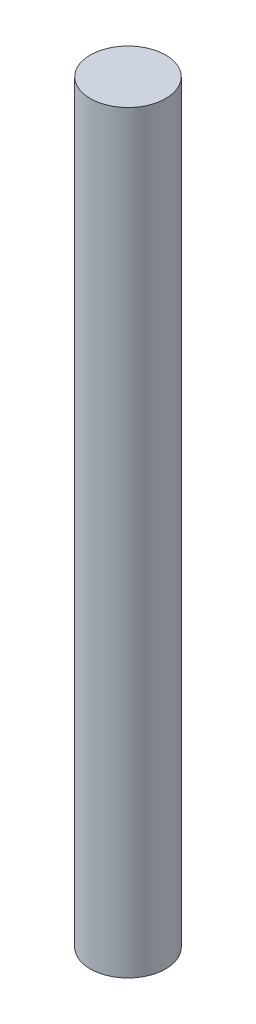
ISO-10303-21;
HEADER;
FILE_DESCRIPTION(('STEP AP214'),'2;1');
FILE_NAME('part.step','',(''),(''),'','','');
FILE_SCHEMA(('AUTOMOTIVE_DESIGN { 1 0 10303 214 1 1 1 1 }'));
ENDSEC;
DATA;
#1=APPLICATION_CONTEXT('core data for automotive mechanical design processes');
#2=APPLICATION_PROTOCOL_DEFINITION('international standard','automotive_design',2000,#1);
#3=PRODUCT_CONTEXT('',#1,'mechanical');
#4=PRODUCT('Part','Part','',(#3));
#5=PRODUCT_RELATED_PRODUCT_CATEGORY('part','',(#4));
#6=PRODUCT_DEFINITION_FORMATION('','',#4);
#7=PRODUCT_DEFINITION_CONTEXT('part definition',#1,'design');
#8=PRODUCT_DEFINITION('design','',#6,#7);
#9=PRODUCT_DEFINITION_SHAPE('','',#8);
#10=(LENGTH_UNIT() NAMED_UNIT(*) SI_UNIT(.MILLI.,.METRE.));
#11=(NAMED_UNIT(*) PLANE_ANGLE_UNIT() SI_UNIT($,.RADIAN.));
#12=(NAMED_UNIT(*) SI_UNIT($,.STERADIAN.) SOLID_ANGLE_UNIT());
#13=UNCERTAINTY_MEASURE_WITH_UNIT(LENGTH_MEASURE(1.E-05),#10,'distance_accuracy_value','');
#14=(GEOMETRIC_REPRESENTATION_CONTEXT(3) GLOBAL_UNCERTAINTY_ASSIGNED_CONTEXT((#13)) GLOBAL_UNIT_ASSIGNED_CONTEXT((#10,
#11,#12)) REPRESENTATION_CONTEXT('',''));
#15=CARTESIAN_POINT('',(0.,0.,0.));
#16=DIRECTION('',(0.,0.,1.));
#17=DIRECTION('',(1.,0.,0.));
#18=AXIS2_PLACEMENT_3D('',#15,#16,#17);
#19=CARTESIAN_POINT('',(0.,50.,0.));
#20=DIRECTION('',(0.,-1.,0.));
#21=DIRECTION('',(0.,0.,-1.));
#22=AXIS2_PLACEMENT_3D('',#19,#20,#21);
#23=CYLINDRICAL_SURFACE('',#22,2.5);
#24=CARTESIAN_POINT('',(0.,50.,0.));
#25=DIRECTION('',(0.,1.,0.));
#26=DIRECTION('',(0.,0.,1.));
#27=AXIS2_PLACEMENT_3D('',#24,#25,#26);
#28=CIRCLE('',#27,2.5);
#29=CARTESIAN_POINT('',(0.,50.,2.5));
#30=VERTEX_POINT('',#29);
#31=EDGE_CURVE('E10',#30,#30,#28,.T.);
#32=ORIENTED_EDGE('',*,*,#31,.F.);
#33=EDGE_LOOP('',(#32));
#34=FACE_BOUND('',#33,.T.);
#35=CARTESIAN_POINT('',(0.,0.,0.));
#36=DIRECTION('',(0.,1.,0.));
#37=DIRECTION('',(0.,0.,1.));
#38=AXIS2_PLACEMENT_3D('',#35,#36,#37);
#39=CIRCLE('',#38,2.5);
#40=CARTESIAN_POINT('',(0.,0.,2.5));
#41=VERTEX_POINT('',#40);
#42=EDGE_CURVE('E33',#41,#41,#39,.T.);
#43=ORIENTED_EDGE('',*,*,#42,.T.);
#44=EDGE_LOOP('',(#43));
#45=FACE_BOUND('',#44,.T.);
#46=ADVANCED_FACE('F30',(#34,#45),#23,.T.);
#47=CARTESIAN_POINT('',(0.,50.,0.));
#48=DIRECTION('',(0.,1.,0.));
#49=DIRECTION('',(0.,0.,1.));
#50=AXIS2_PLACEMENT_3D('',#47,#48,#49);
#51=PLANE('',#50);
#52=ORIENTED_EDGE('',*,*,#31,.T.);
#53=EDGE_LOOP('',(#52));
#54=FACE_BOUND('',#53,.T.);
#55=ADVANCED_FACE('F45',(#54),#51,.T.);
#56=CARTESIAN_POINT('',(0.,0.,0.));
#57=DIRECTION('',(0.,1.,0.));
#58=DIRECTION('',(0.,0.,1.));
#59=AXIS2_PLACEMENT_3D('',#56,#57,#58);
#60=PLANE('',#59);
#61=ORIENTED_EDGE('',*,*,#42,.F.);
#62=EDGE_LOOP('',(#61));
#63=FACE_BOUND('',#62,.T.);
#64=ADVANCED_FACE('F43',(#63),#60,.F.);
#65=CLOSED_SHELL('',(#46,#55,#64));
#66=MANIFOLD_SOLID_BREP('B2',#65);
#67=ADVANCED_BREP_SHAPE_REPRESENTATION('',(#18,#66),#14);
#68=SHAPE_DEFINITION_REPRESENTATION(#9,#67);
ENDSEC;
END-ISO-10303-21;
